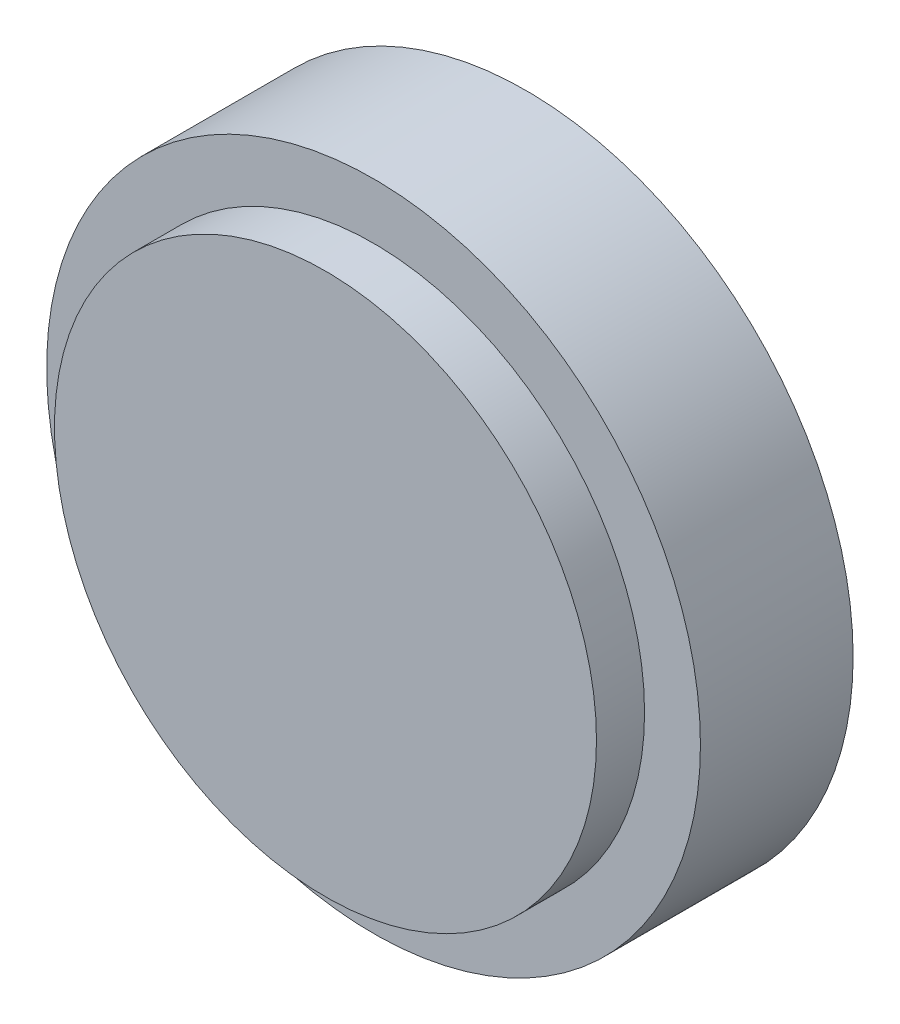
ISO-10303-21;
HEADER;
FILE_DESCRIPTION(('STEP AP214'),'2;1');
FILE_NAME('part.step','',(''),(''),'','','');
FILE_SCHEMA(('AUTOMOTIVE_DESIGN { 1 0 10303 214 1 1 1 1 }'));
ENDSEC;
DATA;
#1=APPLICATION_CONTEXT('core data for automotive mechanical design processes');
#2=APPLICATION_PROTOCOL_DEFINITION('international standard','automotive_design',2000,#1);
#3=PRODUCT_CONTEXT('',#1,'mechanical');
#4=PRODUCT('Part','Part','',(#3));
#5=PRODUCT_RELATED_PRODUCT_CATEGORY('part','',(#4));
#6=PRODUCT_DEFINITION_FORMATION('','',#4);
#7=PRODUCT_DEFINITION_CONTEXT('part definition',#1,'design');
#8=PRODUCT_DEFINITION('design','',#6,#7);
#9=PRODUCT_DEFINITION_SHAPE('','',#8);
#10=(LENGTH_UNIT() NAMED_UNIT(*) SI_UNIT(.MILLI.,.METRE.));
#11=(NAMED_UNIT(*) PLANE_ANGLE_UNIT() SI_UNIT($,.RADIAN.));
#12=(NAMED_UNIT(*) SI_UNIT($,.STERADIAN.) SOLID_ANGLE_UNIT());
#13=UNCERTAINTY_MEASURE_WITH_UNIT(LENGTH_MEASURE(1.E-05),#10,'distance_accuracy_value','');
#14=(GEOMETRIC_REPRESENTATION_CONTEXT(3) GLOBAL_UNCERTAINTY_ASSIGNED_CONTEXT((#13)) GLOBAL_UNIT_ASSIGNED_CONTEXT((#10,
#11,#12)) REPRESENTATION_CONTEXT('',''));
#15=CARTESIAN_POINT('',(0.,0.,0.));
#16=DIRECTION('',(0.,0.,1.));
#17=DIRECTION('',(1.,0.,0.));
#18=AXIS2_PLACEMENT_3D('',#15,#16,#17);
#19=CARTESIAN_POINT('',(0.,0.,20.));
#20=DIRECTION('',(0.,0.,-1.));
#21=DIRECTION('',(-1.,0.,0.));
#22=AXIS2_PLACEMENT_3D('',#19,#20,#21);
#23=CYLINDRICAL_SURFACE('',#22,42.82);
#24=CARTESIAN_POINT('',(0.,0.,20.));
#25=DIRECTION('',(0.,0.,1.));
#26=DIRECTION('',(1.,0.,0.));
#27=AXIS2_PLACEMENT_3D('',#24,#25,#26);
#28=CIRCLE('',#27,42.82);
#29=CARTESIAN_POINT('',(42.82,0.,20.));
#30=VERTEX_POINT('',#29);
#31=EDGE_CURVE('E10',#30,#30,#28,.T.);
#32=ORIENTED_EDGE('',*,*,#31,.F.);
#33=EDGE_LOOP('',(#32));
#34=FACE_BOUND('',#33,.T.);
#35=CARTESIAN_POINT('',(0.,0.,0.));
#36=DIRECTION('',(0.,0.,1.));
#37=DIRECTION('',(1.,0.,0.));
#38=AXIS2_PLACEMENT_3D('',#35,#36,#37);
#39=CIRCLE('',#38,42.82);
#40=CARTESIAN_POINT('',(42.82,0.,0.));
#41=VERTEX_POINT('',#40);
#42=EDGE_CURVE('E38',#41,#41,#39,.T.);
#43=ORIENTED_EDGE('',*,*,#42,.T.);
#44=EDGE_LOOP('',(#43));
#45=FACE_BOUND('',#44,.T.);
#46=ADVANCED_FACE('F35',(#34,#45),#23,.T.);
#47=CARTESIAN_POINT('',(0.,0.,20.));
#48=DIRECTION('',(0.,0.,1.));
#49=DIRECTION('',(1.,0.,0.));
#50=AXIS2_PLACEMENT_3D('',#47,#48,#49);
#51=PLANE('',#50);
#52=CARTESIAN_POINT('',(0.,0.,20.));
#53=DIRECTION('',(0.,0.,1.));
#54=DIRECTION('',(1.,0.,0.));
#55=AXIS2_PLACEMENT_3D('',#52,#53,#54);
#56=CIRCLE('',#55,35.5);
#57=CARTESIAN_POINT('',(35.5,0.,20.));
#58=VERTEX_POINT('',#57);
#59=EDGE_CURVE('E45',#58,#58,#56,.F.);
#60=ORIENTED_EDGE('',*,*,#59,.T.);
#61=EDGE_LOOP('',(#60));
#62=FACE_BOUND('',#61,.T.);
#63=ORIENTED_EDGE('',*,*,#31,.T.);
#64=EDGE_LOOP('',(#63));
#65=FACE_BOUND('',#64,.T.);
#66=ADVANCED_FACE('F65',(#62,#65),#51,.T.);
#67=CARTESIAN_POINT('',(0.,0.,0.));
#68=DIRECTION('',(0.,0.,1.));
#69=DIRECTION('',(1.,0.,0.));
#70=AXIS2_PLACEMENT_3D('',#67,#68,#69);
#71=PLANE('',#70);
#72=ORIENTED_EDGE('',*,*,#42,.F.);
#73=EDGE_LOOP('',(#72));
#74=FACE_BOUND('',#73,.T.);
#75=ADVANCED_FACE('F57',(#74),#71,.F.);
#76=CARTESIAN_POINT('',(0.,0.,26.3));
#77=DIRECTION('',(0.,0.,-1.));
#78=DIRECTION('',(-1.,0.,0.));
#79=AXIS2_PLACEMENT_3D('',#76,#77,#78);
#80=CYLINDRICAL_SURFACE('',#79,35.5);
#81=ORIENTED_EDGE('',*,*,#59,.F.);
#82=EDGE_LOOP('',(#81));
#83=FACE_BOUND('',#82,.T.);
#84=CARTESIAN_POINT('',(0.,0.,26.3));
#85=DIRECTION('',(0.,0.,1.));
#86=DIRECTION('',(1.,0.,0.));
#87=AXIS2_PLACEMENT_3D('',#84,#85,#86);
#88=CIRCLE('',#87,35.5);
#89=CARTESIAN_POINT('',(35.5,0.,26.3));
#90=VERTEX_POINT('',#89);
#91=EDGE_CURVE('E49',#90,#90,#88,.T.);
#92=ORIENTED_EDGE('',*,*,#91,.F.);
#93=EDGE_LOOP('',(#92));
#94=FACE_BOUND('',#93,.T.);
#95=ADVANCED_FACE('F55',(#83,#94),#80,.T.);
#96=CARTESIAN_POINT('',(0.,0.,26.3));
#97=DIRECTION('',(0.,0.,1.));
#98=DIRECTION('',(1.,0.,0.));
#99=AXIS2_PLACEMENT_3D('',#96,#97,#98);
#100=PLANE('',#99);
#101=ORIENTED_EDGE('',*,*,#91,.T.);
#102=EDGE_LOOP('',(#101));
#103=FACE_BOUND('',#102,.T.);
#104=ADVANCED_FACE('F53',(#103),#100,.T.);
#105=CLOSED_SHELL('',(#46,#66,#75,#95,#104));
#106=MANIFOLD_SOLID_BREP('B2',#105);
#107=ADVANCED_BREP_SHAPE_REPRESENTATION('',(#18,#106),#14);
#108=SHAPE_DEFINITION_REPRESENTATION(#9,#107);
ENDSEC;
END-ISO-10303-21;
